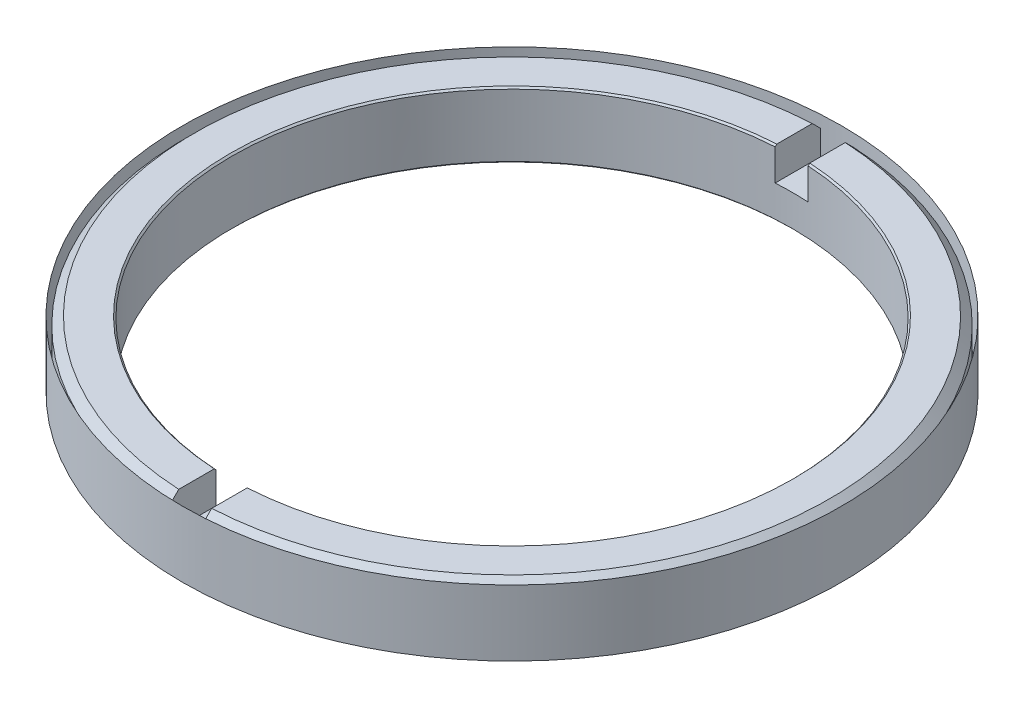
ISO-10303-21;
HEADER;
FILE_DESCRIPTION(('STEP AP214'),'2;1');
FILE_NAME('part.step','',(''),(''),'','','');
FILE_SCHEMA(('AUTOMOTIVE_DESIGN { 1 0 10303 214 1 1 1 1 }'));
ENDSEC;
DATA;
#1=APPLICATION_CONTEXT('core data for automotive mechanical design processes');
#2=APPLICATION_PROTOCOL_DEFINITION('international standard','automotive_design',2000,#1);
#3=PRODUCT_CONTEXT('',#1,'mechanical');
#4=PRODUCT('Part','Part','',(#3));
#5=PRODUCT_RELATED_PRODUCT_CATEGORY('part','',(#4));
#6=PRODUCT_DEFINITION_FORMATION('','',#4);
#7=PRODUCT_DEFINITION_CONTEXT('part definition',#1,'design');
#8=PRODUCT_DEFINITION('design','',#6,#7);
#9=PRODUCT_DEFINITION_SHAPE('','',#8);
#10=(LENGTH_UNIT() NAMED_UNIT(*) SI_UNIT(.MILLI.,.METRE.));
#11=(NAMED_UNIT(*) PLANE_ANGLE_UNIT() SI_UNIT($,.RADIAN.));
#12=(NAMED_UNIT(*) SI_UNIT($,.STERADIAN.) SOLID_ANGLE_UNIT());
#13=UNCERTAINTY_MEASURE_WITH_UNIT(LENGTH_MEASURE(1.E-05),#10,'distance_accuracy_value','');
#14=(GEOMETRIC_REPRESENTATION_CONTEXT(3) GLOBAL_UNCERTAINTY_ASSIGNED_CONTEXT((#13)) GLOBAL_UNIT_ASSIGNED_CONTEXT((#10,
#11,#12)) REPRESENTATION_CONTEXT('',''));
#15=CARTESIAN_POINT('',(0.,0.,0.));
#16=DIRECTION('',(0.,0.,1.));
#17=DIRECTION('',(1.,0.,0.));
#18=AXIS2_PLACEMENT_3D('',#15,#16,#17);
#19=CARTESIAN_POINT('',(0.,4.,0.));
#20=DIRECTION('',(0.,1.,0.));
#21=DIRECTION('',(0.,0.,1.));
#22=AXIS2_PLACEMENT_3D('',#19,#20,#21);
#23=PLANE('',#22);
#24=DIRECTION('',(0.,0.,1.));
#25=VECTOR('',#24,1.);
#26=CARTESIAN_POINT('',(-1.,4.000000000001,-21.71970930816));
#27=LINE('',#26,#25);
#28=CARTESIAN_POINT('',(-1.,4.00000000000213,19.2240084269634));
#29=VERTEX_POINT('',#28);
#30=CARTESIAN_POINT('',(-0.999999999999951,4.00000000000143,17.0707351921377));
#31=VERTEX_POINT('',#30);
#32=EDGE_CURVE('P0_E105',#29,#31,#27,.F.);
#33=ORIENTED_EDGE('',*,*,#32,.T.);
#34=CARTESIAN_POINT('',(-5.226929999935E-13,4.00000000000185,1.6826817716975E-13));
#35=DIRECTION('',(0.,1.,0.));
#36=DIRECTION('',(0.,0.,1.));
#37=AXIS2_PLACEMENT_3D('',#34,#35,#36);
#38=CIRCLE('',#37,17.1000000000028);
#39=CARTESIAN_POINT('',(-1.,4.00000000000092,-17.0707351921369));
#40=VERTEX_POINT('',#39);
#41=EDGE_CURVE('P0_E303',#31,#40,#38,.F.);
#42=ORIENTED_EDGE('',*,*,#41,.T.);
#43=DIRECTION('',(0.,0.,1.));
#44=VECTOR('',#43,1.);
#45=CARTESIAN_POINT('',(-1.,4.,-21.71970930816));
#46=LINE('',#45,#44);
#47=CARTESIAN_POINT('',(-1.,4.00000000000287,-19.2240084269626));
#48=VERTEX_POINT('',#47);
#49=EDGE_CURVE('P0_E108',#40,#48,#46,.F.);
#50=ORIENTED_EDGE('',*,*,#49,.T.);
#51=CARTESIAN_POINT('',(0.,4.00000000000325,0.));
#52=DIRECTION('',(0.,-1.,0.));
#53=DIRECTION('',(1.,0.,0.));
#54=AXIS2_PLACEMENT_3D('',#51,#52,#53);
#55=CIRCLE('',#54,19.2499999999978);
#56=EDGE_CURVE('P0_E19',#29,#48,#55,.T.);
#57=ORIENTED_EDGE('',*,*,#56,.F.);
#58=EDGE_LOOP('',(#33,#42,#50,#57));
#59=FACE_BOUND('',#58,.T.);
#60=ADVANCED_FACE('P0_F16',(#59),#23,.T.);
#61=CARTESIAN_POINT('',(0.,4.,0.));
#62=DIRECTION('',(0.,1.,0.));
#63=DIRECTION('',(0.,0.,1.));
#64=AXIS2_PLACEMENT_3D('',#61,#62,#63);
#65=PLANE('',#64);
#66=DIRECTION('',(0.,0.,-1.));
#67=VECTOR('',#66,1.);
#68=CARTESIAN_POINT('',(1.,4.000000000001,21.36510180925));
#69=LINE('',#68,#67);
#70=CARTESIAN_POINT('',(1.,4.00000000000217,-19.2240084269635));
#71=VERTEX_POINT('',#70);
#72=CARTESIAN_POINT('',(1.,4.00000000000273,-17.0707351921379));
#73=VERTEX_POINT('',#72);
#74=EDGE_CURVE('P0_E230',#71,#73,#69,.F.);
#75=ORIENTED_EDGE('',*,*,#74,.T.);
#76=CARTESIAN_POINT('',(3.238520562832E-13,4.00000000000243,0.));
#77=DIRECTION('',(0.,1.,0.));
#78=DIRECTION('',(0.,0.,1.));
#79=AXIS2_PLACEMENT_3D('',#76,#77,#78);
#80=CIRCLE('',#79,17.1000000000024);
#81=CARTESIAN_POINT('',(1.,4.00000000000122,17.0707351921363));
#82=VERTEX_POINT('',#81);
#83=EDGE_CURVE('P0_E122',#73,#82,#80,.F.);
#84=ORIENTED_EDGE('',*,*,#83,.T.);
#85=DIRECTION('',(0.,0.,-1.));
#86=VECTOR('',#85,1.);
#87=CARTESIAN_POINT('',(1.,4.,21.36510180925));
#88=LINE('',#87,#86);
#89=CARTESIAN_POINT('',(1.,4.00000000000292,19.2240084269624));
#90=VERTEX_POINT('',#89);
#91=EDGE_CURVE('P0_E252',#82,#90,#88,.F.);
#92=ORIENTED_EDGE('',*,*,#91,.T.);
#93=CARTESIAN_POINT('',(0.,4.00000000000333,-1.52655665885959E-13));
#94=DIRECTION('',(0.,-1.,0.));
#95=DIRECTION('',(1.,0.,0.));
#96=AXIS2_PLACEMENT_3D('',#93,#94,#95);
#97=CIRCLE('',#96,19.2499999999977);
#98=EDGE_CURVE('P0_E113',#71,#90,#97,.T.);
#99=ORIENTED_EDGE('',*,*,#98,.F.);
#100=EDGE_LOOP('',(#75,#84,#92,#99));
#101=FACE_BOUND('',#100,.T.);
#102=ADVANCED_FACE('P0_F152',(#101),#65,.T.);
#103=CARTESIAN_POINT('',(0.,3.50000000000043,0.));
#104=DIRECTION('',(0.,-1.,0.));
#105=DIRECTION('',(1.,0.,0.));
#106=AXIS2_PLACEMENT_3D('',#103,#104,#105);
#107=CONICAL_SURFACE('',#106,19.7500000000005,0.7853981633973);
#108=CARTESIAN_POINT('',(-1.,3.50000000000156,19.7246672975737));
#109=CARTESIAN_POINT('',(-1.,3.58333474396102,19.6412255612415));
#110=CARTESIAN_POINT('',(-1.,3.66666878260752,19.5577831205244));
#111=CARTESIAN_POINT('',(-1.,3.83333544927472,19.3908968303206));
#112=CARTESIAN_POINT('',(-1.,3.91666807729543,19.3074529808339));
#113=CARTESIAN_POINT('',(-1.,4.00000000000316,19.2240084269624));
#114=B_SPLINE_CURVE_WITH_KNOTS('',3,(#108,#109,#110,#111,#112,#113),.UNSPECIFIED.,.F.,.F.,(4,2,
4),(0.,0.353786413234851,0.707572826470348),.UNSPECIFIED.);
#115=CARTESIAN_POINT('',(-1.00000000000012,3.50000000000078,19.7246672975741));
#116=VERTEX_POINT('',#115);
#117=EDGE_CURVE('P0_E117',#116,#29,#114,.T.);
#118=ORIENTED_EDGE('',*,*,#117,.T.);
#119=ORIENTED_EDGE('',*,*,#56,.T.);
#120=CARTESIAN_POINT('',(-1.,4.00000000000249,-19.224008426963));
#121=CARTESIAN_POINT('',(-1.,3.91666807729469,-19.3074529808346));
#122=CARTESIAN_POINT('',(-1.,3.83333544927391,-19.3908968303214));
#123=CARTESIAN_POINT('',(-1.,3.66666878260657,-19.5577831205254));
#124=CARTESIAN_POINT('',(-1.,3.58333474396001,-19.6412255612425));
#125=CARTESIAN_POINT('',(-1.,3.50000000000047,-19.7246672975748));
#126=B_SPLINE_CURVE_WITH_KNOTS('',3,(#120,#121,#122,#123,#124,#125),.UNSPECIFIED.,.F.,.F.,(4,2,
4),(0.,0.353786413235797,0.707572826470949),.UNSPECIFIED.);
#127=CARTESIAN_POINT('',(-1.00000000000011,3.50000000000023,-19.7246672975746));
#128=VERTEX_POINT('',#127);
#129=EDGE_CURVE('P0_E156',#48,#128,#126,.T.);
#130=ORIENTED_EDGE('',*,*,#129,.T.);
#131=CARTESIAN_POINT('',(0.,3.5,0.));
#132=DIRECTION('',(0.,1.,0.));
#133=DIRECTION('',(0.,0.,1.));
#134=AXIS2_PLACEMENT_3D('',#131,#132,#133);
#135=CIRCLE('',#134,19.75);
#136=EDGE_CURVE('P0_E126',#116,#128,#135,.F.);
#137=ORIENTED_EDGE('',*,*,#136,.F.);
#138=EDGE_LOOP('',(#118,#119,#130,#137));
#139=FACE_BOUND('',#138,.T.);
#140=ADVANCED_FACE('P0_F125',(#139),#107,.T.);
#141=CARTESIAN_POINT('',(0.,3.50000000000044,-1.52655665885959E-13));
#142=DIRECTION('',(0.,-1.,0.));
#143=DIRECTION('',(1.,0.,0.));
#144=AXIS2_PLACEMENT_3D('',#141,#142,#143);
#145=CONICAL_SURFACE('',#144,19.7500000000005,0.785398163397299);
#146=CARTESIAN_POINT('',(1.,3.50000000000164,-19.7246672975738));
#147=CARTESIAN_POINT('',(1.,3.5833347439611,-19.6412255612415));
#148=CARTESIAN_POINT('',(1.,3.6666687826076,-19.5577831205245));
#149=CARTESIAN_POINT('',(1.,3.83333544927479,-19.3908968303207));
#150=CARTESIAN_POINT('',(1.,3.9166680772955,-19.307452980834));
#151=CARTESIAN_POINT('',(1.,4.00000000000323,-19.2240084269624));
#152=B_SPLINE_CURVE_WITH_KNOTS('',3,(#146,#147,#148,#149,#150,#151),.UNSPECIFIED.,.F.,.F.,(4,2,
4),(0.,0.35378641323485,0.707572826470346),.UNSPECIFIED.);
#153=CARTESIAN_POINT('',(1.00000000000011,3.50000000000082,-19.7246672975741));
#154=VERTEX_POINT('',#153);
#155=EDGE_CURVE('P0_E224',#154,#71,#152,.T.);
#156=ORIENTED_EDGE('',*,*,#155,.T.);
#157=ORIENTED_EDGE('',*,*,#98,.T.);
#158=CARTESIAN_POINT('',(1.,4.00000000000251,19.2240084269629));
#159=CARTESIAN_POINT('',(1.,3.91666807729474,19.3074529808344));
#160=CARTESIAN_POINT('',(1.,3.833335449274,19.3908968303212));
#161=CARTESIAN_POINT('',(1.,3.66666878260674,19.5577831205251));
#162=CARTESIAN_POINT('',(1.,3.58333474396021,19.6412255612421));
#163=CARTESIAN_POINT('',(1.,3.50000000000071,19.7246672975744));
#164=B_SPLINE_CURVE_WITH_KNOTS('',3,(#158,#159,#160,#161,#162,#163),.UNSPECIFIED.,.F.,.F.,(4,2,
4),(0.,0.353786413235639,0.707572826470629),.UNSPECIFIED.);
#165=CARTESIAN_POINT('',(1.00000000000011,3.50000000000036,19.7246672975744));
#166=VERTEX_POINT('',#165);
#167=EDGE_CURVE('P0_E140',#90,#166,#164,.T.);
#168=ORIENTED_EDGE('',*,*,#167,.T.);
#169=CARTESIAN_POINT('',(0.,3.5,0.));
#170=DIRECTION('',(0.,1.,0.));
#171=DIRECTION('',(0.,0.,1.));
#172=AXIS2_PLACEMENT_3D('',#169,#170,#171);
#173=CIRCLE('',#172,19.75);
#174=EDGE_CURVE('P0_E266',#154,#166,#173,.F.);
#175=ORIENTED_EDGE('',*,*,#174,.F.);
#176=EDGE_LOOP('',(#156,#157,#168,#175));
#177=FACE_BOUND('',#176,.T.);
#178=ADVANCED_FACE('P0_F151',(#177),#145,.T.);
#179=CARTESIAN_POINT('',(1.,4.,21.36510180925));
#180=DIRECTION('',(1.,0.,0.));
#181=DIRECTION('',(0.,0.,-1.));
#182=AXIS2_PLACEMENT_3D('',#179,#180,#181);
#183=PLANE('',#182);
#184=DIRECTION('',(0.,0.,1.));
#185=VECTOR('',#184,1.);
#186=CARTESIAN_POINT('',(1.,2.,0.));
#187=LINE('',#186,#185);
#188=CARTESIAN_POINT('',(1.00000000000011,2.,19.7246672975744));
#189=VERTEX_POINT('',#188);
#190=CARTESIAN_POINT('',(0.999999999999916,2.,16.9705627484771));
#191=VERTEX_POINT('',#190);
#192=EDGE_CURVE('P0_E130',#189,#191,#187,.F.);
#193=ORIENTED_EDGE('',*,*,#192,.F.);
#194=DIRECTION('',(0.,1.,0.));
#195=VECTOR('',#194,1.);
#196=CARTESIAN_POINT('',(1.00000000000022,0.,19.7246672975744));
#197=LINE('',#196,#195);
#198=EDGE_CURVE('P0_E238',#166,#189,#197,.F.);
#199=ORIENTED_EDGE('',*,*,#198,.F.);
#200=ORIENTED_EDGE('',*,*,#167,.F.);
#201=ORIENTED_EDGE('',*,*,#91,.F.);
#202=DIRECTION('',(0.,0.706497363851819,0.707715673749303));
#203=VECTOR('',#202,1.);
#204=CARTESIAN_POINT('',(1.,3.90000000000142,16.9705627484786));
#205=LINE('',#204,#203);
#206=CARTESIAN_POINT('',(0.999999999999916,3.9,16.9705627484772));
#207=VERTEX_POINT('',#206);
#208=EDGE_CURVE('P0_E304',#82,#207,#205,.F.);
#209=ORIENTED_EDGE('',*,*,#208,.T.);
#210=DIRECTION('',(0.,1.,0.));
#211=VECTOR('',#210,1.);
#212=CARTESIAN_POINT('',(0.999999999999832,0.,16.9705627484772));
#213=LINE('',#212,#211);
#214=EDGE_CURVE('P0_E243',#207,#191,#213,.F.);
#215=ORIENTED_EDGE('',*,*,#214,.T.);
#216=EDGE_LOOP('',(#193,#199,#200,#201,#209,#215));
#217=FACE_BOUND('',#216,.T.);
#218=ADVANCED_FACE('P0_F321',(#217),#183,.F.);
#219=CARTESIAN_POINT('',(0.,2.,0.));
#220=DIRECTION('',(0.,1.,0.));
#221=DIRECTION('',(0.,0.,1.));
#222=AXIS2_PLACEMENT_3D('',#219,#220,#221);
#223=PLANE('',#222);
#224=ORIENTED_EDGE('',*,*,#192,.T.);
#225=CARTESIAN_POINT('',(0.,2.,0.));
#226=DIRECTION('',(0.,1.,0.));
#227=DIRECTION('',(0.,0.,1.));
#228=AXIS2_PLACEMENT_3D('',#225,#226,#227);
#229=CIRCLE('',#228,17.);
#230=CARTESIAN_POINT('',(-0.99999999999992,2.,16.9705627484771));
#231=VERTEX_POINT('',#230);
#232=EDGE_CURVE('P0_E239',#191,#231,#229,.F.);
#233=ORIENTED_EDGE('',*,*,#232,.T.);
#234=DIRECTION('',(0.,0.,1.));
#235=VECTOR('',#234,1.);
#236=CARTESIAN_POINT('',(-1.,2.,-21.71970930816));
#237=LINE('',#236,#235);
#238=CARTESIAN_POINT('',(-1.00000000000012,2.,19.7246672975744));
#239=VERTEX_POINT('',#238);
#240=EDGE_CURVE('P0_E127',#231,#239,#237,.T.);
#241=ORIENTED_EDGE('',*,*,#240,.T.);
#242=CARTESIAN_POINT('',(0.,2.,0.));
#243=DIRECTION('',(0.,1.,0.));
#244=DIRECTION('',(0.,0.,1.));
#245=AXIS2_PLACEMENT_3D('',#242,#243,#244);
#246=CIRCLE('',#245,19.75);
#247=EDGE_CURVE('P0_E235',#189,#239,#246,.F.);
#248=ORIENTED_EDGE('',*,*,#247,.F.);
#249=EDGE_LOOP('',(#224,#233,#241,#248));
#250=FACE_BOUND('',#249,.T.);
#251=ADVANCED_FACE('P0_F195',(#250),#223,.T.);
#252=CARTESIAN_POINT('',(-1.,4.,-21.71970930816));
#253=DIRECTION('',(-1.,0.,0.));
#254=DIRECTION('',(0.,0.,1.));
#255=AXIS2_PLACEMENT_3D('',#252,#253,#254);
#256=PLANE('',#255);
#257=ORIENTED_EDGE('',*,*,#117,.F.);
#258=DIRECTION('',(0.,1.,0.));
#259=VECTOR('',#258,1.);
#260=CARTESIAN_POINT('',(-1.00000000000023,0.,19.7246672975744));
#261=LINE('',#260,#259);
#262=EDGE_CURVE('P0_E237',#239,#116,#261,.T.);
#263=ORIENTED_EDGE('',*,*,#262,.F.);
#264=ORIENTED_EDGE('',*,*,#240,.F.);
#265=DIRECTION('',(0.,1.,0.));
#266=VECTOR('',#265,1.);
#267=CARTESIAN_POINT('',(-0.999999999999839,0.,16.9705627484771));
#268=LINE('',#267,#266);
#269=CARTESIAN_POINT('',(-0.99999999999996,3.8999999999994,16.9705627484778));
#270=VERTEX_POINT('',#269);
#271=EDGE_CURVE('P0_E242',#231,#270,#268,.T.);
#272=ORIENTED_EDGE('',*,*,#271,.T.);
#273=DIRECTION('',(0.,-0.706497363851825,-0.707715673749297));
#274=VECTOR('',#273,1.);
#275=CARTESIAN_POINT('',(-1.,4.00000000000185,17.0707351921382));
#276=LINE('',#275,#274);
#277=EDGE_CURVE('P0_E121',#270,#31,#276,.F.);
#278=ORIENTED_EDGE('',*,*,#277,.T.);
#279=ORIENTED_EDGE('',*,*,#32,.F.);
#280=EDGE_LOOP('',(#257,#263,#264,#272,#278,#279));
#281=FACE_BOUND('',#280,.T.);
#282=ADVANCED_FACE('P0_F115',(#281),#256,.F.);
#283=CARTESIAN_POINT('',(3.238520562832E-13,4.00000000000245,0.));
#284=DIRECTION('',(0.,1.,0.));
#285=DIRECTION('',(0.,0.,1.));
#286=AXIS2_PLACEMENT_3D('',#283,#284,#285);
#287=CONICAL_SURFACE('',#286,17.1000000000024,0.785398163397318);
#288=CARTESIAN_POINT('',(0.,3.9,0.));
#289=DIRECTION('',(0.,1.,0.));
#290=DIRECTION('',(0.,0.,1.));
#291=AXIS2_PLACEMENT_3D('',#288,#289,#290);
#292=CIRCLE('',#291,17.);
#293=CARTESIAN_POINT('',(0.999999999999915,3.89999999999999,-16.9705627484772));
#294=VERTEX_POINT('',#293);
#295=EDGE_CURVE('P0_E275',#294,#207,#292,.F.);
#296=ORIENTED_EDGE('',*,*,#295,.T.);
#297=ORIENTED_EDGE('',*,*,#208,.F.);
#298=ORIENTED_EDGE('',*,*,#83,.F.);
#299=CARTESIAN_POINT('',(1.,4.00000000000303,-17.0707351921382));
#300=CARTESIAN_POINT('',(1.,3.98333324883454,-17.0540398692172));
#301=CARTESIAN_POINT('',(1.,3.9666665399167,-17.0373445041183));
#302=CARTESIAN_POINT('',(1.,3.93333320658235,-17.0039536895646));
#303=CARTESIAN_POINT('',(1.,3.91666658216583,-16.9872582401099));
#304=CARTESIAN_POINT('',(1.,3.89999999999998,-16.9705627484772));
#305=B_SPLINE_CURVE_WITH_KNOTS('',3,(#299,#300,#301,#302,#303,#304),.UNSPECIFIED.,.F.,.F.,(4,2,
4),(0.,0.0707716724222226,0.141543344844452),.UNSPECIFIED.);
#306=EDGE_CURVE('P0_E164',#73,#294,#305,.T.);
#307=ORIENTED_EDGE('',*,*,#306,.T.);
#308=EDGE_LOOP('',(#296,#297,#298,#307));
#309=FACE_BOUND('',#308,.T.);
#310=ADVANCED_FACE('P0_F186',(#309),#287,.F.);
#311=CARTESIAN_POINT('',(-5.226929999935E-13,4.00000000000202,1.6826817716975E-13));
#312=DIRECTION('',(0.,1.,0.));
#313=DIRECTION('',(0.,0.,1.));
#314=AXIS2_PLACEMENT_3D('',#311,#312,#313);
#315=CONICAL_SURFACE('',#314,17.100000000003,0.785398163397297);
#316=ORIENTED_EDGE('',*,*,#277,.F.);
#317=CARTESIAN_POINT('',(0.,3.9,0.));
#318=DIRECTION('',(0.,1.,0.));
#319=DIRECTION('',(0.,0.,1.));
#320=AXIS2_PLACEMENT_3D('',#317,#318,#319);
#321=CIRCLE('',#320,17.);
#322=CARTESIAN_POINT('',(-0.999999999999913,3.89999999999978,-16.9705627484774));
#323=VERTEX_POINT('',#322);
#324=EDGE_CURVE('P0_E279',#270,#323,#321,.F.);
#325=ORIENTED_EDGE('',*,*,#324,.T.);
#326=CARTESIAN_POINT('',(-1.,3.89999999999957,-16.9705627484776));
#327=CARTESIAN_POINT('',(-1.,3.91666658216531,-16.9872582401102));
#328=CARTESIAN_POINT('',(-1.,3.93333320658172,-17.0039536895648));
#329=CARTESIAN_POINT('',(-1.,3.96666653991586,-17.0373445041183));
#330=CARTESIAN_POINT('',(-1.,3.98333324883359,-17.0540398692171));
#331=CARTESIAN_POINT('',(-1.,4.00000000000199,-17.0707351921379));
#332=B_SPLINE_CURVE_WITH_KNOTS('',3,(#326,#327,#328,#329,#330,#331),.UNSPECIFIED.,.F.,.F.,(4,2,
4),(0.,0.0707716724217766,0.141543344843552),.UNSPECIFIED.);
#333=EDGE_CURVE('P0_E170',#323,#40,#332,.T.);
#334=ORIENTED_EDGE('',*,*,#333,.T.);
#335=ORIENTED_EDGE('',*,*,#41,.F.);
#336=EDGE_LOOP('',(#316,#325,#334,#335));
#337=FACE_BOUND('',#336,.T.);
#338=ADVANCED_FACE('P0_F181',(#337),#315,.F.);
#339=CARTESIAN_POINT('',(-1.,4.,-21.71970930816));
#340=DIRECTION('',(-1.,0.,0.));
#341=DIRECTION('',(0.,0.,1.));
#342=AXIS2_PLACEMENT_3D('',#339,#340,#341);
#343=PLANE('',#342);
#344=DIRECTION('',(0.,0.,1.));
#345=VECTOR('',#344,1.);
#346=CARTESIAN_POINT('',(-1.,2.,0.));
#347=LINE('',#346,#345);
#348=CARTESIAN_POINT('',(-1.00000000000011,2.,-19.7246672975744));
#349=VERTEX_POINT('',#348);
#350=CARTESIAN_POINT('',(-0.999999999999913,2.,-16.9705627484771));
#351=VERTEX_POINT('',#350);
#352=EDGE_CURVE('P0_E163',#349,#351,#347,.T.);
#353=ORIENTED_EDGE('',*,*,#352,.F.);
#354=DIRECTION('',(0.,1.,0.));
#355=VECTOR('',#354,1.);
#356=CARTESIAN_POINT('',(-1.00000000000022,0.,-19.7246672975744));
#357=LINE('',#356,#355);
#358=EDGE_CURVE('P0_E234',#128,#349,#357,.F.);
#359=ORIENTED_EDGE('',*,*,#358,.F.);
#360=ORIENTED_EDGE('',*,*,#129,.F.);
#361=ORIENTED_EDGE('',*,*,#49,.F.);
#362=ORIENTED_EDGE('',*,*,#333,.F.);
#363=DIRECTION('',(0.,1.,0.));
#364=VECTOR('',#363,1.);
#365=CARTESIAN_POINT('',(-0.999999999999825,0.,-16.9705627484772));
#366=LINE('',#365,#364);
#367=EDGE_CURVE('P0_E248',#323,#351,#366,.F.);
#368=ORIENTED_EDGE('',*,*,#367,.T.);
#369=EDGE_LOOP('',(#353,#359,#360,#361,#362,#368));
#370=FACE_BOUND('',#369,.T.);
#371=ADVANCED_FACE('P0_F176',(#370),#343,.F.);
#372=CARTESIAN_POINT('',(0.,2.,0.));
#373=DIRECTION('',(0.,1.,0.));
#374=DIRECTION('',(0.,0.,1.));
#375=AXIS2_PLACEMENT_3D('',#372,#373,#374);
#376=PLANE('',#375);
#377=ORIENTED_EDGE('',*,*,#352,.T.);
#378=CARTESIAN_POINT('',(0.,2.,0.));
#379=DIRECTION('',(0.,1.,0.));
#380=DIRECTION('',(0.,0.,1.));
#381=AXIS2_PLACEMENT_3D('',#378,#379,#380);
#382=CIRCLE('',#381,17.);
#383=CARTESIAN_POINT('',(0.999999999999915,2.,-16.9705627484771));
#384=VERTEX_POINT('',#383);
#385=EDGE_CURVE('P0_E244',#351,#384,#382,.F.);
#386=ORIENTED_EDGE('',*,*,#385,.T.);
#387=DIRECTION('',(0.,0.,-1.));
#388=VECTOR('',#387,1.);
#389=CARTESIAN_POINT('',(1.,2.,21.36510180925));
#390=LINE('',#389,#388);
#391=CARTESIAN_POINT('',(1.00000000000011,2.,-19.7246672975744));
#392=VERTEX_POINT('',#391);
#393=EDGE_CURVE('P0_E34',#384,#392,#390,.T.);
#394=ORIENTED_EDGE('',*,*,#393,.T.);
#395=CARTESIAN_POINT('',(0.,2.,0.));
#396=DIRECTION('',(0.,1.,0.));
#397=DIRECTION('',(0.,0.,1.));
#398=AXIS2_PLACEMENT_3D('',#395,#396,#397);
#399=CIRCLE('',#398,19.75);
#400=EDGE_CURVE('P0_E231',#349,#392,#399,.F.);
#401=ORIENTED_EDGE('',*,*,#400,.F.);
#402=EDGE_LOOP('',(#377,#386,#394,#401));
#403=FACE_BOUND('',#402,.T.);
#404=ADVANCED_FACE('P0_F180',(#403),#376,.T.);
#405=CARTESIAN_POINT('',(1.,4.,21.36510180925));
#406=DIRECTION('',(1.,0.,0.));
#407=DIRECTION('',(0.,0.,-1.));
#408=AXIS2_PLACEMENT_3D('',#405,#406,#407);
#409=PLANE('',#408);
#410=ORIENTED_EDGE('',*,*,#155,.F.);
#411=DIRECTION('',(0.,1.,0.));
#412=VECTOR('',#411,1.);
#413=CARTESIAN_POINT('',(1.00000000000022,0.,-19.7246672975744));
#414=LINE('',#413,#412);
#415=EDGE_CURVE('P0_E233',#392,#154,#414,.T.);
#416=ORIENTED_EDGE('',*,*,#415,.F.);
#417=ORIENTED_EDGE('',*,*,#393,.F.);
#418=DIRECTION('',(0.,1.,0.));
#419=VECTOR('',#418,1.);
#420=CARTESIAN_POINT('',(0.99999999999983,0.,-16.9705627484772));
#421=LINE('',#420,#419);
#422=EDGE_CURVE('P0_E247',#384,#294,#421,.T.);
#423=ORIENTED_EDGE('',*,*,#422,.T.);
#424=ORIENTED_EDGE('',*,*,#306,.F.);
#425=ORIENTED_EDGE('',*,*,#74,.F.);
#426=EDGE_LOOP('',(#410,#416,#417,#423,#424,#425));
#427=FACE_BOUND('',#426,.T.);
#428=ADVANCED_FACE('P0_F219',(#427),#409,.F.);
#429=CARTESIAN_POINT('',(0.,0.,0.));
#430=DIRECTION('',(0.,1.,0.));
#431=DIRECTION('',(0.,0.,1.));
#432=AXIS2_PLACEMENT_3D('',#429,#430,#431);
#433=CYLINDRICAL_SURFACE('',#432,19.75);
#434=CARTESIAN_POINT('',(0.,0.499999999999785,0.));
#435=DIRECTION('',(0.,1.,0.));
#436=DIRECTION('',(0.,0.,-1.));
#437=AXIS2_PLACEMENT_3D('',#434,#435,#436);
#438=CIRCLE('',#437,19.7500000000002);
#439=CARTESIAN_POINT('',(0.,0.499999999999786,-19.7500000000003));
#440=VERTEX_POINT('',#439);
#441=EDGE_CURVE('P0_E286',#440,#440,#438,.F.);
#442=ORIENTED_EDGE('',*,*,#441,.F.);
#443=EDGE_LOOP('',(#442));
#444=FACE_BOUND('',#443,.T.);
#445=ORIENTED_EDGE('',*,*,#136,.T.);
#446=ORIENTED_EDGE('',*,*,#358,.T.);
#447=ORIENTED_EDGE('',*,*,#400,.T.);
#448=ORIENTED_EDGE('',*,*,#415,.T.);
#449=ORIENTED_EDGE('',*,*,#174,.T.);
#450=ORIENTED_EDGE('',*,*,#198,.T.);
#451=ORIENTED_EDGE('',*,*,#247,.T.);
#452=ORIENTED_EDGE('',*,*,#262,.T.);
#453=EDGE_LOOP('',(#445,#446,#447,#448,#449,#450,#451,#452));
#454=FACE_BOUND('',#453,.T.);
#455=ADVANCED_FACE('P0_F216',(#444,#454),#433,.T.);
#456=CARTESIAN_POINT('',(0.,0.,0.));
#457=DIRECTION('',(0.,1.,0.));
#458=DIRECTION('',(0.,0.,1.));
#459=AXIS2_PLACEMENT_3D('',#456,#457,#458);
#460=CYLINDRICAL_SURFACE('',#459,17.);
#461=CARTESIAN_POINT('',(0.,0.100000000000697,0.));
#462=DIRECTION('',(0.,-1.,0.));
#463=DIRECTION('',(0.,0.,-1.));
#464=AXIS2_PLACEMENT_3D('',#461,#462,#463);
#465=CIRCLE('',#464,17.0000000000007);
#466=CARTESIAN_POINT('',(0.,0.100000000000697,-17.0000000000007));
#467=VERTEX_POINT('',#466);
#468=EDGE_CURVE('P0_E250',#467,#467,#465,.T.);
#469=ORIENTED_EDGE('',*,*,#468,.T.);
#470=EDGE_LOOP('',(#469));
#471=FACE_BOUND('',#470,.T.);
#472=ORIENTED_EDGE('',*,*,#385,.F.);
#473=ORIENTED_EDGE('',*,*,#367,.F.);
#474=ORIENTED_EDGE('',*,*,#324,.F.);
#475=ORIENTED_EDGE('',*,*,#271,.F.);
#476=ORIENTED_EDGE('',*,*,#232,.F.);
#477=ORIENTED_EDGE('',*,*,#214,.F.);
#478=ORIENTED_EDGE('',*,*,#295,.F.);
#479=ORIENTED_EDGE('',*,*,#422,.F.);
#480=EDGE_LOOP('',(#472,#473,#474,#475,#476,#477,#478,#479));
#481=FACE_BOUND('',#480,.T.);
#482=ADVANCED_FACE('P0_F212',(#471,#481),#460,.F.);
#483=CARTESIAN_POINT('',(0.,0.499999999999787,0.));
#484=DIRECTION('',(0.,1.,0.));
#485=DIRECTION('',(0.,0.,1.));
#486=AXIS2_PLACEMENT_3D('',#483,#484,#485);
#487=CONICAL_SURFACE('',#486,19.7500000000002,0.7853981633973);
#488=ORIENTED_EDGE('',*,*,#441,.T.);
#489=EDGE_LOOP('',(#488));
#490=FACE_BOUND('',#489,.T.);
#491=CARTESIAN_POINT('',(0.,-2.8796409701215E-13,0.));
#492=DIRECTION('',(0.,1.,0.));
#493=DIRECTION('',(0.,0.,1.));
#494=AXIS2_PLACEMENT_3D('',#491,#492,#493);
#495=CIRCLE('',#494,19.2500000000003);
#496=CARTESIAN_POINT('',(0.,-2.8796409701215E-13,19.2500000000003));
#497=VERTEX_POINT('',#496);
#498=EDGE_CURVE('P0_E25',#497,#497,#495,.T.);
#499=ORIENTED_EDGE('',*,*,#498,.T.);
#500=EDGE_LOOP('',(#499));
#501=FACE_BOUND('',#500,.T.);
#502=ADVANCED_FACE('P0_F204',(#490,#501),#487,.T.);
#503=CARTESIAN_POINT('',(0.,6.82451057471001E-13,0.));
#504=DIRECTION('',(0.,-1.,0.));
#505=DIRECTION('',(0.,0.,-1.));
#506=AXIS2_PLACEMENT_3D('',#503,#504,#505);
#507=CONICAL_SURFACE('',#506,17.1000000000007,0.785398163397299);
#508=ORIENTED_EDGE('',*,*,#468,.F.);
#509=EDGE_LOOP('',(#508));
#510=FACE_BOUND('',#509,.T.);
#511=CARTESIAN_POINT('',(0.,6.83481049534862E-13,0.));
#512=DIRECTION('',(0.,-1.,0.));
#513=DIRECTION('',(0.,0.,-1.));
#514=AXIS2_PLACEMENT_3D('',#511,#512,#513);
#515=CIRCLE('',#514,17.1000000000007);
#516=CARTESIAN_POINT('',(0.,6.83481049534862E-13,-17.1000000000007));
#517=VERTEX_POINT('',#516);
#518=EDGE_CURVE('P0_E11',#517,#517,#515,.T.);
#519=ORIENTED_EDGE('',*,*,#518,.T.);
#520=EDGE_LOOP('',(#519));
#521=FACE_BOUND('',#520,.T.);
#522=ADVANCED_FACE('P0_F198',(#510,#521),#507,.F.);
#523=CARTESIAN_POINT('',(0.,0.,0.));
#524=DIRECTION('',(0.,1.,0.));
#525=DIRECTION('',(0.,0.,1.));
#526=AXIS2_PLACEMENT_3D('',#523,#524,#525);
#527=PLANE('',#526);
#528=ORIENTED_EDGE('',*,*,#518,.F.);
#529=EDGE_LOOP('',(#528));
#530=FACE_BOUND('',#529,.T.);
#531=ORIENTED_EDGE('',*,*,#498,.F.);
#532=EDGE_LOOP('',(#531));
#533=FACE_BOUND('',#532,.T.);
#534=ADVANCED_FACE('P0_F196',(#530,#533),#527,.F.);
#535=CLOSED_SHELL('',(#60,#102,#140,#178,#218,#251,#282,#310,#338,#371,#404,#428,#455,#482,#502,
#522,#534));
#536=MANIFOLD_SOLID_BREP('P0_B1',#535);
#537=CARTESIAN_POINT('',(0.,4.,0.));
#538=DIRECTION('',(0.,1.,0.));
#539=DIRECTION('',(0.,0.,1.));
#540=AXIS2_PLACEMENT_3D('',#537,#538,#539);
#541=CYLINDRICAL_SURFACE('',#540,20.);
#542=CARTESIAN_POINT('',(0.,0.,0.));
#543=DIRECTION('',(0.,1.,0.));
#544=DIRECTION('',(0.,0.,1.));
#545=AXIS2_PLACEMENT_3D('',#542,#543,#544);
#546=CIRCLE('',#545,20.);
#547=CARTESIAN_POINT('',(0.,0.,20.));
#548=VERTEX_POINT('',#547);
#549=EDGE_CURVE('P1_E20',#548,#548,#546,.T.);
#550=ORIENTED_EDGE('',*,*,#549,.T.);
#551=EDGE_LOOP('',(#550));
#552=FACE_BOUND('',#551,.T.);
#553=CARTESIAN_POINT('',(0.,4.,0.));
#554=DIRECTION('',(0.,1.,0.));
#555=DIRECTION('',(0.,0.,1.));
#556=AXIS2_PLACEMENT_3D('',#553,#554,#555);
#557=CIRCLE('',#556,20.);
#558=CARTESIAN_POINT('',(0.,4.,20.));
#559=VERTEX_POINT('',#558);
#560=EDGE_CURVE('P1_E11',#559,#559,#557,.F.);
#561=ORIENTED_EDGE('',*,*,#560,.T.);
#562=EDGE_LOOP('',(#561));
#563=FACE_BOUND('',#562,.T.);
#564=ADVANCED_FACE('P1_F16',(#552,#563),#541,.T.);
#565=CARTESIAN_POINT('',(0.,0.,0.));
#566=DIRECTION('',(0.,1.,0.));
#567=DIRECTION('',(0.,0.,1.));
#568=AXIS2_PLACEMENT_3D('',#565,#566,#567);
#569=PLANE('',#568);
#570=CARTESIAN_POINT('',(19.25,0.,0.));
#571=CARTESIAN_POINT('',(19.2485231762282,0.,1.90278046786394));
#572=CARTESIAN_POINT('',(18.8801895770815,0.,3.75463895979115));
#573=CARTESIAN_POINT('',(18.5100771889685,0.,5.61544060938864));
#574=CARTESIAN_POINT('',(17.7846576529432,0.,7.36676508971026));
#575=CARTESIAN_POINT('',(17.0592603614642,0.,9.118035866738));
#576=CARTESIAN_POINT('',(16.0057860693563,0.,10.6947336887975));
#577=CARTESIAN_POINT('',(14.9528038723957,0.,12.2706950094039));
#578=CARTESIAN_POINT('',(13.6117911593069,0.,13.6117866600612));
#579=CARTESIAN_POINT('',(12.2716387671974,0.,14.9520179390972));
#580=CARTESIAN_POINT('',(10.6947241540426,0.,16.0057873609178));
#581=CARTESIAN_POINT('',(9.11879941489795,0.,17.0588953017968));
#582=CARTESIAN_POINT('',(7.36665241839319,0.,17.7846698357779));
#583=CARTESIAN_POINT('',(5.61548254481292,0.,18.5100396257869));
#584=CARTESIAN_POINT('',(3.75548448533596,0.,18.8800986964742));
#585=CARTESIAN_POINT('',(1.8965503891109,0.,19.249946084547));
#586=CARTESIAN_POINT('',(0.,0.,19.2500000000034));
#587=CARTESIAN_POINT('',(-1.89545730531426,0.,19.2500538843854));
#588=CARTESIAN_POINT('',(-3.75548448533596,0.,18.8800986964742));
#589=CARTESIAN_POINT('',(-5.61443217724854,0.,18.5103582162998));
#590=CARTESIAN_POINT('',(-7.36665241839319,0.,17.7846698357779));
#591=CARTESIAN_POINT('',(-9.11783114721313,0.,17.0594128013701));
#592=CARTESIAN_POINT('',(-10.6947241540426,0.,16.0057873609178));
#593=CARTESIAN_POINT('',(-12.2707901906522,0.,14.9527144734024));
#594=CARTESIAN_POINT('',(-13.6117911593069,0.,13.6117866600612));
#595=CARTESIAN_POINT('',(-14.9521072518799,0.,12.2715436854397));
#596=CARTESIAN_POINT('',(-16.0057860693563,0.,10.6947336887975));
#597=CARTESIAN_POINT('',(-17.0587425242514,0.,9.11900469380434));
#598=CARTESIAN_POINT('',(-17.7846576529432,0.,7.36676508971039));
#599=CARTESIAN_POINT('',(-18.5097588888594,0.,5.61649008877493));
#600=CARTESIAN_POINT('',(-18.8801895770813,0.,3.75463895979194));
#601=CARTESIAN_POINT('',(-19.2485227494645,0.,1.9033303219047));
#602=CARTESIAN_POINT('',(-19.25,0.,0.));
#603=B_SPLINE_CURVE_WITH_KNOTS('',2,(#570,#571,#572,#573,#574,#575,#576,#577,#578,#579,#580,
#581,#582,#583,#584,#585,#586,#587,#588,#589,#590,#591,#592,#593,#594,#595,#596,#597,#598,#599,
#600,#601,#602),.UNSPECIFIED.,.F.,.F.,(3,2,2,2,2,2,2,2,2,2,2,2,2,2,2,2,3),(0.,0.0625,0.125,
0.1875,0.25,0.3125,0.375,0.4375,0.5,0.5625,0.625,0.6875,0.75,0.8125,0.875,0.9375,1.),.UNSPECIFIED.);
#604=CARTESIAN_POINT('',(19.25,0.,0.));
#605=VERTEX_POINT('',#604);
#606=CARTESIAN_POINT('',(-19.25,0.,0.));
#607=VERTEX_POINT('',#606);
#608=EDGE_CURVE('P1_E28',#605,#607,#603,.T.);
#609=ORIENTED_EDGE('',*,*,#608,.F.);
#610=CARTESIAN_POINT('',(-19.25,0.,0.));
#611=CARTESIAN_POINT('',(-19.2485231762282,0.,-1.90278046786394));
#612=CARTESIAN_POINT('',(-18.8801895770815,0.,-3.75463895979115));
#613=CARTESIAN_POINT('',(-18.5100771889685,0.,-5.61544060938864));
#614=CARTESIAN_POINT('',(-17.7846576529432,0.,-7.36676508971026));
#615=CARTESIAN_POINT('',(-17.0592603614642,0.,-9.118035866738));
#616=CARTESIAN_POINT('',(-16.0057860693563,0.,-10.6947336887975));
#617=CARTESIAN_POINT('',(-14.9528038723957,0.,-12.2706950094039));
#618=CARTESIAN_POINT('',(-13.6117911593069,0.,-13.6117866600612));
#619=CARTESIAN_POINT('',(-12.2716387671974,0.,-14.9520179390972));
#620=CARTESIAN_POINT('',(-10.6947241540426,0.,-16.0057873609178));
#621=CARTESIAN_POINT('',(-9.11879941489795,0.,-17.0588953017968));
#622=CARTESIAN_POINT('',(-7.36665241839319,0.,-17.7846698357779));
#623=CARTESIAN_POINT('',(-5.61548254481292,0.,-18.5100396257869));
#624=CARTESIAN_POINT('',(-3.75548448533596,0.,-18.8800986964742));
#625=CARTESIAN_POINT('',(-1.8965503891109,0.,-19.249946084547));
#626=CARTESIAN_POINT('',(0.,0.,-19.2500000000034));
#627=CARTESIAN_POINT('',(1.89545730531426,0.,-19.2500538843854));
#628=CARTESIAN_POINT('',(3.75548448533596,0.,-18.8800986964742));
#629=CARTESIAN_POINT('',(5.61443217724854,0.,-18.5103582162998));
#630=CARTESIAN_POINT('',(7.36665241839319,0.,-17.7846698357779));
#631=CARTESIAN_POINT('',(9.11783114721313,0.,-17.0594128013701));
#632=CARTESIAN_POINT('',(10.6947241540426,0.,-16.0057873609178));
#633=CARTESIAN_POINT('',(12.2707901906522,0.,-14.9527144734024));
#634=CARTESIAN_POINT('',(13.6117911593069,0.,-13.6117866600612));
#635=CARTESIAN_POINT('',(14.9521072518799,0.,-12.2715436854397));
#636=CARTESIAN_POINT('',(16.0057860693563,0.,-10.6947336887975));
#637=CARTESIAN_POINT('',(17.0587425242514,0.,-9.11900469380434));
#638=CARTESIAN_POINT('',(17.7846576529432,0.,-7.36676508971039));
#639=CARTESIAN_POINT('',(18.5097588888594,0.,-5.61649008877493));
#640=CARTESIAN_POINT('',(18.8801895770813,0.,-3.75463895979194));
#641=CARTESIAN_POINT('',(19.2485227494645,0.,-1.9033303219047));
#642=CARTESIAN_POINT('',(19.25,0.,0.));
#643=B_SPLINE_CURVE_WITH_KNOTS('',2,(#610,#611,#612,#613,#614,#615,#616,#617,#618,#619,#620,
#621,#622,#623,#624,#625,#626,#627,#628,#629,#630,#631,#632,#633,#634,#635,#636,#637,#638,#639,
#640,#641,#642),.UNSPECIFIED.,.F.,.F.,(3,2,2,2,2,2,2,2,2,2,2,2,2,2,2,2,3),(0.,0.0625,0.125,
0.1875,0.25,0.3125,0.375,0.4375,0.5,0.5625,0.625,0.6875,0.75,0.8125,0.875,0.9375,1.),.UNSPECIFIED.);
#644=EDGE_CURVE('P1_E33',#607,#605,#643,.T.);
#645=ORIENTED_EDGE('',*,*,#644,.F.);
#646=EDGE_LOOP('',(#609,#645));
#647=FACE_BOUND('',#646,.T.);
#648=ORIENTED_EDGE('',*,*,#549,.F.);
#649=EDGE_LOOP('',(#648));
#650=FACE_BOUND('',#649,.T.);
#651=ADVANCED_FACE('P1_F17',(#647,#650),#569,.F.);
#652=OPEN_SHELL('',(#564,#651));
#653=SHELL_BASED_SURFACE_MODEL('P1_B1',(#652));
#654=ADVANCED_BREP_SHAPE_REPRESENTATION('',(#18,#536),#14);
#655=MANIFOLD_SURFACE_SHAPE_REPRESENTATION('',(#18,#653),#14);
#656=SHAPE_REPRESENTATION('',(#18),#14);
#657=SHAPE_DEFINITION_REPRESENTATION(#9,#656);
#658=SHAPE_REPRESENTATION_RELATIONSHIP('','',#656,#654);
#659=SHAPE_REPRESENTATION_RELATIONSHIP('','',#656,#655);
ENDSEC;
END-ISO-10303-21;
